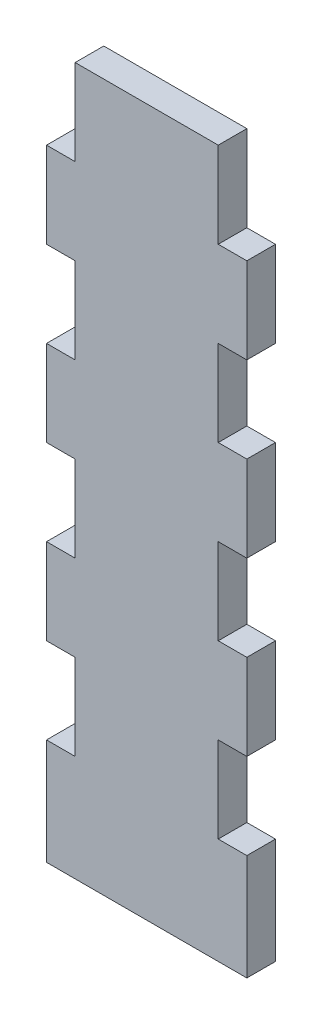
ISO-10303-21;
HEADER;
FILE_DESCRIPTION(('STEP AP214'),'2;1');
FILE_NAME('part.step','',(''),(''),'','','');
FILE_SCHEMA(('AUTOMOTIVE_DESIGN { 1 0 10303 214 1 1 1 1 }'));
ENDSEC;
DATA;
#1=APPLICATION_CONTEXT('core data for automotive mechanical design processes');
#2=APPLICATION_PROTOCOL_DEFINITION('international standard','automotive_design',2000,#1);
#3=PRODUCT_CONTEXT('',#1,'mechanical');
#4=PRODUCT('Part','Part','',(#3));
#5=PRODUCT_RELATED_PRODUCT_CATEGORY('part','',(#4));
#6=PRODUCT_DEFINITION_FORMATION('','',#4);
#7=PRODUCT_DEFINITION_CONTEXT('part definition',#1,'design');
#8=PRODUCT_DEFINITION('design','',#6,#7);
#9=PRODUCT_DEFINITION_SHAPE('','',#8);
#10=(LENGTH_UNIT() NAMED_UNIT(*) SI_UNIT(.MILLI.,.METRE.));
#11=(NAMED_UNIT(*) PLANE_ANGLE_UNIT() SI_UNIT($,.RADIAN.));
#12=(NAMED_UNIT(*) SI_UNIT($,.STERADIAN.) SOLID_ANGLE_UNIT());
#13=UNCERTAINTY_MEASURE_WITH_UNIT(LENGTH_MEASURE(1.E-05),#10,'distance_accuracy_value','');
#14=(GEOMETRIC_REPRESENTATION_CONTEXT(3) GLOBAL_UNCERTAINTY_ASSIGNED_CONTEXT((#13)) GLOBAL_UNIT_ASSIGNED_CONTEXT((#10,
#11,#12)) REPRESENTATION_CONTEXT('',''));
#15=CARTESIAN_POINT('',(0.,0.,0.));
#16=DIRECTION('',(0.,0.,1.));
#17=DIRECTION('',(1.,0.,0.));
#18=AXIS2_PLACEMENT_3D('',#15,#16,#17);
#19=CARTESIAN_POINT('',(24.0093371905544,83.7010211727563,6.));
#20=DIRECTION('',(0.,-1.,0.));
#21=DIRECTION('',(0.,0.,-1.));
#22=AXIS2_PLACEMENT_3D('',#19,#20,#21);
#23=PLANE('',#22);
#24=DIRECTION('',(-1.,0.,0.));
#25=VECTOR('',#24,1.);
#26=CARTESIAN_POINT('',(24.0093371905544,83.7010211727563,0.));
#27=LINE('',#26,#25);
#28=CARTESIAN_POINT('',(24.0093371905544,83.7010211727563,0.));
#29=VERTEX_POINT('',#28);
#30=CARTESIAN_POINT('',(18.0093371905544,83.7010211727563,0.));
#31=VERTEX_POINT('',#30);
#32=EDGE_CURVE('E284',#29,#31,#27,.T.);
#33=ORIENTED_EDGE('',*,*,#32,.F.);
#34=DIRECTION('',(0.,0.,-1.));
#35=VECTOR('',#34,1.);
#36=CARTESIAN_POINT('',(24.0093371905544,83.7010211727563,6.));
#37=LINE('',#36,#35);
#38=CARTESIAN_POINT('',(24.0093371905544,83.7010211727563,6.));
#39=VERTEX_POINT('',#38);
#40=EDGE_CURVE('E11',#39,#29,#37,.T.);
#41=ORIENTED_EDGE('',*,*,#40,.F.);
#42=DIRECTION('',(-1.,0.,0.));
#43=VECTOR('',#42,1.);
#44=CARTESIAN_POINT('',(24.0093371905544,83.7010211727563,6.));
#45=LINE('',#44,#43);
#46=CARTESIAN_POINT('',(18.0093371905544,83.7010211727563,6.));
#47=VERTEX_POINT('',#46);
#48=EDGE_CURVE('E404',#39,#47,#45,.T.);
#49=ORIENTED_EDGE('',*,*,#48,.T.);
#50=DIRECTION('',(0.,0.,-1.));
#51=VECTOR('',#50,1.);
#52=CARTESIAN_POINT('',(18.0093371905544,83.7010211727563,6.));
#53=LINE('',#52,#51);
#54=EDGE_CURVE('E42',#47,#31,#53,.T.);
#55=ORIENTED_EDGE('',*,*,#54,.T.);
#56=EDGE_LOOP('',(#33,#41,#49,#55));
#57=FACE_BOUND('',#56,.T.);
#58=ADVANCED_FACE('F39',(#57),#23,.T.);
#59=CARTESIAN_POINT('',(24.0093371905544,83.7010211727563,6.));
#60=DIRECTION('',(1.,0.,0.));
#61=DIRECTION('',(0.,0.,-1.));
#62=AXIS2_PLACEMENT_3D('',#59,#60,#61);
#63=PLANE('',#62);
#64=DIRECTION('',(0.,-1.,0.));
#65=VECTOR('',#64,1.);
#66=CARTESIAN_POINT('',(24.0093371905544,83.7010211727563,0.));
#67=LINE('',#66,#65);
#68=CARTESIAN_POINT('',(24.0093371905544,65.7010211727563,0.));
#69=VERTEX_POINT('',#68);
#70=EDGE_CURVE('E402',#29,#69,#67,.T.);
#71=ORIENTED_EDGE('',*,*,#70,.T.);
#72=DIRECTION('',(0.,0.,-1.));
#73=VECTOR('',#72,1.);
#74=CARTESIAN_POINT('',(24.0093371905544,65.7010211727563,6.));
#75=LINE('',#74,#73);
#76=CARTESIAN_POINT('',(24.0093371905544,65.7010211727563,6.));
#77=VERTEX_POINT('',#76);
#78=EDGE_CURVE('E49',#77,#69,#75,.T.);
#79=ORIENTED_EDGE('',*,*,#78,.F.);
#80=DIRECTION('',(0.,-1.,0.));
#81=VECTOR('',#80,1.);
#82=CARTESIAN_POINT('',(24.0093371905544,83.7010211727563,6.));
#83=LINE('',#82,#81);
#84=EDGE_CURVE('E277',#39,#77,#83,.T.);
#85=ORIENTED_EDGE('',*,*,#84,.F.);
#86=ORIENTED_EDGE('',*,*,#40,.T.);
#87=EDGE_LOOP('',(#71,#79,#85,#86));
#88=FACE_BOUND('',#87,.T.);
#89=ADVANCED_FACE('F499',(#88),#63,.F.);
#90=CARTESIAN_POINT('',(18.0093371905544,65.7010211727563,6.));
#91=DIRECTION('',(0.,1.,0.));
#92=DIRECTION('',(0.,0.,1.));
#93=AXIS2_PLACEMENT_3D('',#90,#91,#92);
#94=PLANE('',#93);
#95=DIRECTION('',(1.,0.,0.));
#96=VECTOR('',#95,1.);
#97=CARTESIAN_POINT('',(18.0093371905544,65.7010211727563,0.));
#98=LINE('',#97,#96);
#99=CARTESIAN_POINT('',(18.0093371905544,65.7010211727563,0.));
#100=VERTEX_POINT('',#99);
#101=EDGE_CURVE('E261',#100,#69,#98,.T.);
#102=ORIENTED_EDGE('',*,*,#101,.F.);
#103=DIRECTION('',(0.,0.,-1.));
#104=VECTOR('',#103,1.);
#105=CARTESIAN_POINT('',(18.0093371905544,65.7010211727563,6.));
#106=LINE('',#105,#104);
#107=CARTESIAN_POINT('',(18.0093371905544,65.7010211727563,6.));
#108=VERTEX_POINT('',#107);
#109=EDGE_CURVE('E255',#108,#100,#106,.T.);
#110=ORIENTED_EDGE('',*,*,#109,.F.);
#111=DIRECTION('',(1.,0.,0.));
#112=VECTOR('',#111,1.);
#113=CARTESIAN_POINT('',(18.0093371905544,65.7010211727563,6.));
#114=LINE('',#113,#112);
#115=EDGE_CURVE('E259',#108,#77,#114,.T.);
#116=ORIENTED_EDGE('',*,*,#115,.T.);
#117=ORIENTED_EDGE('',*,*,#78,.T.);
#118=EDGE_LOOP('',(#102,#110,#116,#117));
#119=FACE_BOUND('',#118,.T.);
#120=ADVANCED_FACE('F257',(#119),#94,.T.);
#121=CARTESIAN_POINT('',(18.0093371905544,65.7010211727563,6.));
#122=DIRECTION('',(1.,0.,0.));
#123=DIRECTION('',(0.,0.,-1.));
#124=AXIS2_PLACEMENT_3D('',#121,#122,#123);
#125=PLANE('',#124);
#126=DIRECTION('',(0.,-1.,0.));
#127=VECTOR('',#126,1.);
#128=CARTESIAN_POINT('',(18.0093371905544,65.7010211727563,0.));
#129=LINE('',#128,#127);
#130=CARTESIAN_POINT('',(18.0093371905544,47.7010211727563,0.));
#131=VERTEX_POINT('',#130);
#132=EDGE_CURVE('E397',#100,#131,#129,.T.);
#133=ORIENTED_EDGE('',*,*,#132,.T.);
#134=DIRECTION('',(0.,0.,-1.));
#135=VECTOR('',#134,1.);
#136=CARTESIAN_POINT('',(18.0093371905544,47.7010211727563,6.));
#137=LINE('',#136,#135);
#138=CARTESIAN_POINT('',(18.0093371905544,47.7010211727563,6.));
#139=VERTEX_POINT('',#138);
#140=EDGE_CURVE('E266',#139,#131,#137,.T.);
#141=ORIENTED_EDGE('',*,*,#140,.F.);
#142=DIRECTION('',(0.,-1.,0.));
#143=VECTOR('',#142,1.);
#144=CARTESIAN_POINT('',(18.0093371905544,65.7010211727563,6.));
#145=LINE('',#144,#143);
#146=EDGE_CURVE('E269',#108,#139,#145,.T.);
#147=ORIENTED_EDGE('',*,*,#146,.F.);
#148=ORIENTED_EDGE('',*,*,#109,.T.);
#149=EDGE_LOOP('',(#133,#141,#147,#148));
#150=FACE_BOUND('',#149,.T.);
#151=ADVANCED_FACE('F270',(#150),#125,.F.);
#152=CARTESIAN_POINT('',(24.0093371905544,47.7010211727563,6.));
#153=DIRECTION('',(0.,-1.,0.));
#154=DIRECTION('',(0.,0.,-1.));
#155=AXIS2_PLACEMENT_3D('',#152,#153,#154);
#156=PLANE('',#155);
#157=DIRECTION('',(-1.,0.,0.));
#158=VECTOR('',#157,1.);
#159=CARTESIAN_POINT('',(24.0093371905544,47.7010211727563,0.));
#160=LINE('',#159,#158);
#161=CARTESIAN_POINT('',(24.0093371905544,47.7010211727563,0.));
#162=VERTEX_POINT('',#161);
#163=EDGE_CURVE('E393',#162,#131,#160,.T.);
#164=ORIENTED_EDGE('',*,*,#163,.F.);
#165=DIRECTION('',(0.,0.,-1.));
#166=VECTOR('',#165,1.);
#167=CARTESIAN_POINT('',(24.0093371905544,47.7010211727563,6.));
#168=LINE('',#167,#166);
#169=CARTESIAN_POINT('',(24.0093371905544,47.7010211727563,6.));
#170=VERTEX_POINT('',#169);
#171=EDGE_CURVE('E410',#170,#162,#168,.T.);
#172=ORIENTED_EDGE('',*,*,#171,.F.);
#173=DIRECTION('',(-1.,0.,0.));
#174=VECTOR('',#173,1.);
#175=CARTESIAN_POINT('',(24.0093371905544,47.7010211727563,6.));
#176=LINE('',#175,#174);
#177=EDGE_CURVE('E274',#170,#139,#176,.T.);
#178=ORIENTED_EDGE('',*,*,#177,.T.);
#179=ORIENTED_EDGE('',*,*,#140,.T.);
#180=EDGE_LOOP('',(#164,#172,#178,#179));
#181=FACE_BOUND('',#180,.T.);
#182=ADVANCED_FACE('F598',(#181),#156,.T.);
#183=CARTESIAN_POINT('',(24.0093371905544,47.7010211727563,6.));
#184=DIRECTION('',(1.,0.,0.));
#185=DIRECTION('',(0.,0.,-1.));
#186=AXIS2_PLACEMENT_3D('',#183,#184,#185);
#187=PLANE('',#186);
#188=DIRECTION('',(0.,-1.,0.));
#189=VECTOR('',#188,1.);
#190=CARTESIAN_POINT('',(24.0093371905544,47.7010211727563,0.));
#191=LINE('',#190,#189);
#192=CARTESIAN_POINT('',(24.0093371905544,29.7010211727563,0.));
#193=VERTEX_POINT('',#192);
#194=EDGE_CURVE('E389',#162,#193,#191,.T.);
#195=ORIENTED_EDGE('',*,*,#194,.T.);
#196=DIRECTION('',(0.,0.,-1.));
#197=VECTOR('',#196,1.);
#198=CARTESIAN_POINT('',(24.0093371905544,29.7010211727563,6.));
#199=LINE('',#198,#197);
#200=CARTESIAN_POINT('',(24.0093371905544,29.7010211727563,6.));
#201=VERTEX_POINT('',#200);
#202=EDGE_CURVE('E413',#201,#193,#199,.T.);
#203=ORIENTED_EDGE('',*,*,#202,.F.);
#204=DIRECTION('',(0.,-1.,0.));
#205=VECTOR('',#204,1.);
#206=CARTESIAN_POINT('',(24.0093371905544,47.7010211727563,6.));
#207=LINE('',#206,#205);
#208=EDGE_CURVE('E593',#170,#201,#207,.T.);
#209=ORIENTED_EDGE('',*,*,#208,.F.);
#210=ORIENTED_EDGE('',*,*,#171,.T.);
#211=EDGE_LOOP('',(#195,#203,#209,#210));
#212=FACE_BOUND('',#211,.T.);
#213=ADVANCED_FACE('F604',(#212),#187,.F.);
#214=CARTESIAN_POINT('',(18.0093371905544,29.7010211727563,6.));
#215=DIRECTION('',(0.,1.,0.));
#216=DIRECTION('',(0.,0.,1.));
#217=AXIS2_PLACEMENT_3D('',#214,#215,#216);
#218=PLANE('',#217);
#219=DIRECTION('',(1.,0.,0.));
#220=VECTOR('',#219,1.);
#221=CARTESIAN_POINT('',(18.0093371905544,29.7010211727563,0.));
#222=LINE('',#221,#220);
#223=CARTESIAN_POINT('',(18.0093371905544,29.7010211727563,0.));
#224=VERTEX_POINT('',#223);
#225=EDGE_CURVE('E385',#224,#193,#222,.T.);
#226=ORIENTED_EDGE('',*,*,#225,.F.);
#227=DIRECTION('',(0.,0.,-1.));
#228=VECTOR('',#227,1.);
#229=CARTESIAN_POINT('',(18.0093371905544,29.7010211727563,6.));
#230=LINE('',#229,#228);
#231=CARTESIAN_POINT('',(18.0093371905544,29.7010211727563,6.));
#232=VERTEX_POINT('',#231);
#233=EDGE_CURVE('E416',#232,#224,#230,.T.);
#234=ORIENTED_EDGE('',*,*,#233,.F.);
#235=DIRECTION('',(1.,0.,0.));
#236=VECTOR('',#235,1.);
#237=CARTESIAN_POINT('',(18.0093371905544,29.7010211727563,6.));
#238=LINE('',#237,#236);
#239=EDGE_CURVE('E589',#232,#201,#238,.T.);
#240=ORIENTED_EDGE('',*,*,#239,.T.);
#241=ORIENTED_EDGE('',*,*,#202,.T.);
#242=EDGE_LOOP('',(#226,#234,#240,#241));
#243=FACE_BOUND('',#242,.T.);
#244=ADVANCED_FACE('F609',(#243),#218,.T.);
#245=CARTESIAN_POINT('',(18.0093371905544,29.7010211727563,6.));
#246=DIRECTION('',(1.,0.,0.));
#247=DIRECTION('',(0.,0.,-1.));
#248=AXIS2_PLACEMENT_3D('',#245,#246,#247);
#249=PLANE('',#248);
#250=DIRECTION('',(0.,-1.,0.));
#251=VECTOR('',#250,1.);
#252=CARTESIAN_POINT('',(18.0093371905544,29.7010211727563,0.));
#253=LINE('',#252,#251);
#254=CARTESIAN_POINT('',(18.0093371905544,7.47016653515465,0.));
#255=VERTEX_POINT('',#254);
#256=EDGE_CURVE('E382',#224,#255,#253,.T.);
#257=ORIENTED_EDGE('',*,*,#256,.T.);
#258=DIRECTION('',(0.,0.,-1.));
#259=VECTOR('',#258,1.);
#260=CARTESIAN_POINT('',(18.0093371905544,7.47016653515465,6.));
#261=LINE('',#260,#259);
#262=CARTESIAN_POINT('',(18.0093371905544,7.47016653515465,6.));
#263=VERTEX_POINT('',#262);
#264=EDGE_CURVE('E419',#263,#255,#261,.T.);
#265=ORIENTED_EDGE('',*,*,#264,.F.);
#266=DIRECTION('',(0.,1.,0.));
#267=VECTOR('',#266,1.);
#268=CARTESIAN_POINT('',(18.0093371905544,7.47016653515465,6.));
#269=LINE('',#268,#267);
#270=EDGE_CURVE('E586',#263,#232,#269,.T.);
#271=ORIENTED_EDGE('',*,*,#270,.T.);
#272=ORIENTED_EDGE('',*,*,#233,.T.);
#273=EDGE_LOOP('',(#257,#265,#271,#272));
#274=FACE_BOUND('',#273,.T.);
#275=ADVANCED_FACE('F612',(#274),#249,.F.);
#276=CARTESIAN_POINT('',(18.0093371905544,7.47016653515465,6.));
#277=DIRECTION('',(0.,1.,0.));
#278=DIRECTION('',(0.,0.,1.));
#279=AXIS2_PLACEMENT_3D('',#276,#277,#278);
#280=PLANE('',#279);
#281=DIRECTION('',(1.,0.,0.));
#282=VECTOR('',#281,1.);
#283=CARTESIAN_POINT('',(18.0093371905544,7.47016653515465,0.));
#284=LINE('',#283,#282);
#285=CARTESIAN_POINT('',(60.0093371905544,7.47016653515465,0.));
#286=VERTEX_POINT('',#285);
#287=EDGE_CURVE('E379',#255,#286,#284,.T.);
#288=ORIENTED_EDGE('',*,*,#287,.T.);
#289=DIRECTION('',(0.,0.,-1.));
#290=VECTOR('',#289,1.);
#291=CARTESIAN_POINT('',(60.0093371905544,7.47016653515465,6.));
#292=LINE('',#291,#290);
#293=CARTESIAN_POINT('',(60.0093371905544,7.47016653515465,6.));
#294=VERTEX_POINT('',#293);
#295=EDGE_CURVE('E423',#294,#286,#292,.T.);
#296=ORIENTED_EDGE('',*,*,#295,.F.);
#297=DIRECTION('',(1.,0.,0.));
#298=VECTOR('',#297,1.);
#299=CARTESIAN_POINT('',(18.0093371905544,7.47016653515465,6.));
#300=LINE('',#299,#298);
#301=EDGE_CURVE('E582',#263,#294,#300,.T.);
#302=ORIENTED_EDGE('',*,*,#301,.F.);
#303=ORIENTED_EDGE('',*,*,#264,.T.);
#304=EDGE_LOOP('',(#288,#296,#302,#303));
#305=FACE_BOUND('',#304,.T.);
#306=ADVANCED_FACE('F618',(#305),#280,.F.);
#307=CARTESIAN_POINT('',(60.0093371905544,7.47016653515465,6.));
#308=DIRECTION('',(-1.,0.,0.));
#309=DIRECTION('',(0.,0.,1.));
#310=AXIS2_PLACEMENT_3D('',#307,#308,#309);
#311=PLANE('',#310);
#312=DIRECTION('',(0.,1.,0.));
#313=VECTOR('',#312,1.);
#314=CARTESIAN_POINT('',(60.0093371905544,7.47016653515465,0.));
#315=LINE('',#314,#313);
#316=CARTESIAN_POINT('',(60.0093371905544,29.7010211727563,0.));
#317=VERTEX_POINT('',#316);
#318=EDGE_CURVE('E376',#286,#317,#315,.T.);
#319=ORIENTED_EDGE('',*,*,#318,.T.);
#320=DIRECTION('',(0.,0.,-1.));
#321=VECTOR('',#320,1.);
#322=CARTESIAN_POINT('',(60.0093371905544,29.7010211727563,6.));
#323=LINE('',#322,#321);
#324=CARTESIAN_POINT('',(60.0093371905544,29.7010211727563,6.));
#325=VERTEX_POINT('',#324);
#326=EDGE_CURVE('E427',#325,#317,#323,.T.);
#327=ORIENTED_EDGE('',*,*,#326,.F.);
#328=DIRECTION('',(0.,-1.,0.));
#329=VECTOR('',#328,1.);
#330=CARTESIAN_POINT('',(60.0093371905544,29.7010211727563,6.));
#331=LINE('',#330,#329);
#332=EDGE_CURVE('E579',#325,#294,#331,.T.);
#333=ORIENTED_EDGE('',*,*,#332,.T.);
#334=ORIENTED_EDGE('',*,*,#295,.T.);
#335=EDGE_LOOP('',(#319,#327,#333,#334));
#336=FACE_BOUND('',#335,.T.);
#337=ADVANCED_FACE('F621',(#336),#311,.F.);
#338=CARTESIAN_POINT('',(60.0093371905544,29.7010211727563,6.));
#339=DIRECTION('',(0.,-1.,0.));
#340=DIRECTION('',(0.,0.,-1.));
#341=AXIS2_PLACEMENT_3D('',#338,#339,#340);
#342=PLANE('',#341);
#343=DIRECTION('',(-1.,0.,0.));
#344=VECTOR('',#343,1.);
#345=CARTESIAN_POINT('',(60.0093371905544,29.7010211727563,0.));
#346=LINE('',#345,#344);
#347=CARTESIAN_POINT('',(54.0093371905544,29.7010211727563,0.));
#348=VERTEX_POINT('',#347);
#349=EDGE_CURVE('E372',#317,#348,#346,.T.);
#350=ORIENTED_EDGE('',*,*,#349,.T.);
#351=DIRECTION('',(0.,0.,-1.));
#352=VECTOR('',#351,1.);
#353=CARTESIAN_POINT('',(54.0093371905544,29.7010211727563,6.));
#354=LINE('',#353,#352);
#355=CARTESIAN_POINT('',(54.0093371905544,29.7010211727563,6.));
#356=VERTEX_POINT('',#355);
#357=EDGE_CURVE('E431',#356,#348,#354,.T.);
#358=ORIENTED_EDGE('',*,*,#357,.F.);
#359=DIRECTION('',(-1.,0.,0.));
#360=VECTOR('',#359,1.);
#361=CARTESIAN_POINT('',(60.0093371905544,29.7010211727563,6.));
#362=LINE('',#361,#360);
#363=EDGE_CURVE('E576',#325,#356,#362,.T.);
#364=ORIENTED_EDGE('',*,*,#363,.F.);
#365=ORIENTED_EDGE('',*,*,#326,.T.);
#366=EDGE_LOOP('',(#350,#358,#364,#365));
#367=FACE_BOUND('',#366,.T.);
#368=ADVANCED_FACE('F627',(#367),#342,.F.);
#369=CARTESIAN_POINT('',(54.0093371905544,47.7010211727563,6.));
#370=DIRECTION('',(1.,0.,0.));
#371=DIRECTION('',(0.,0.,-1.));
#372=AXIS2_PLACEMENT_3D('',#369,#370,#371);
#373=PLANE('',#372);
#374=DIRECTION('',(0.,-1.,0.));
#375=VECTOR('',#374,1.);
#376=CARTESIAN_POINT('',(54.0093371905544,47.7010211727563,0.));
#377=LINE('',#376,#375);
#378=CARTESIAN_POINT('',(54.0093371905544,47.7010211727563,0.));
#379=VERTEX_POINT('',#378);
#380=EDGE_CURVE('E368',#379,#348,#377,.T.);
#381=ORIENTED_EDGE('',*,*,#380,.F.);
#382=DIRECTION('',(0.,0.,-1.));
#383=VECTOR('',#382,1.);
#384=CARTESIAN_POINT('',(54.0093371905544,47.7010211727563,6.));
#385=LINE('',#384,#383);
#386=CARTESIAN_POINT('',(54.0093371905544,47.7010211727563,6.));
#387=VERTEX_POINT('',#386);
#388=EDGE_CURVE('E434',#387,#379,#385,.T.);
#389=ORIENTED_EDGE('',*,*,#388,.F.);
#390=DIRECTION('',(0.,-1.,0.));
#391=VECTOR('',#390,1.);
#392=CARTESIAN_POINT('',(54.0093371905544,47.7010211727563,6.));
#393=LINE('',#392,#391);
#394=EDGE_CURVE('E572',#387,#356,#393,.T.);
#395=ORIENTED_EDGE('',*,*,#394,.T.);
#396=ORIENTED_EDGE('',*,*,#357,.T.);
#397=EDGE_LOOP('',(#381,#389,#395,#396));
#398=FACE_BOUND('',#397,.T.);
#399=ADVANCED_FACE('F630',(#398),#373,.T.);
#400=CARTESIAN_POINT('',(54.0093371905544,47.7010211727563,6.));
#401=DIRECTION('',(0.,1.,0.));
#402=DIRECTION('',(0.,0.,1.));
#403=AXIS2_PLACEMENT_3D('',#400,#401,#402);
#404=PLANE('',#403);
#405=DIRECTION('',(1.,0.,0.));
#406=VECTOR('',#405,1.);
#407=CARTESIAN_POINT('',(54.0093371905544,47.7010211727563,0.));
#408=LINE('',#407,#406);
#409=CARTESIAN_POINT('',(60.0093371905544,47.7010211727563,0.));
#410=VERTEX_POINT('',#409);
#411=EDGE_CURVE('E364',#379,#410,#408,.T.);
#412=ORIENTED_EDGE('',*,*,#411,.T.);
#413=DIRECTION('',(0.,0.,-1.));
#414=VECTOR('',#413,1.);
#415=CARTESIAN_POINT('',(60.0093371905544,47.7010211727563,6.));
#416=LINE('',#415,#414);
#417=CARTESIAN_POINT('',(60.0093371905544,47.7010211727563,6.));
#418=VERTEX_POINT('',#417);
#419=EDGE_CURVE('E437',#418,#410,#416,.T.);
#420=ORIENTED_EDGE('',*,*,#419,.F.);
#421=DIRECTION('',(1.,0.,0.));
#422=VECTOR('',#421,1.);
#423=CARTESIAN_POINT('',(54.0093371905544,47.7010211727563,6.));
#424=LINE('',#423,#422);
#425=EDGE_CURVE('E569',#387,#418,#424,.T.);
#426=ORIENTED_EDGE('',*,*,#425,.F.);
#427=ORIENTED_EDGE('',*,*,#388,.T.);
#428=EDGE_LOOP('',(#412,#420,#426,#427));
#429=FACE_BOUND('',#428,.T.);
#430=ADVANCED_FACE('F635',(#429),#404,.F.);
#431=CARTESIAN_POINT('',(60.0093371905544,65.7010211727563,6.));
#432=DIRECTION('',(1.,0.,0.));
#433=DIRECTION('',(0.,0.,-1.));
#434=AXIS2_PLACEMENT_3D('',#431,#432,#433);
#435=PLANE('',#434);
#436=DIRECTION('',(0.,-1.,0.));
#437=VECTOR('',#436,1.);
#438=CARTESIAN_POINT('',(60.0093371905544,65.7010211727563,0.));
#439=LINE('',#438,#437);
#440=CARTESIAN_POINT('',(60.0093371905544,65.7010211727563,0.));
#441=VERTEX_POINT('',#440);
#442=EDGE_CURVE('E360',#441,#410,#439,.T.);
#443=ORIENTED_EDGE('',*,*,#442,.F.);
#444=DIRECTION('',(0.,0.,-1.));
#445=VECTOR('',#444,1.);
#446=CARTESIAN_POINT('',(60.0093371905544,65.7010211727563,6.));
#447=LINE('',#446,#445);
#448=CARTESIAN_POINT('',(60.0093371905544,65.7010211727563,6.));
#449=VERTEX_POINT('',#448);
#450=EDGE_CURVE('E440',#449,#441,#447,.T.);
#451=ORIENTED_EDGE('',*,*,#450,.F.);
#452=DIRECTION('',(0.,-1.,0.));
#453=VECTOR('',#452,1.);
#454=CARTESIAN_POINT('',(60.0093371905544,65.7010211727563,6.));
#455=LINE('',#454,#453);
#456=EDGE_CURVE('E565',#449,#418,#455,.T.);
#457=ORIENTED_EDGE('',*,*,#456,.T.);
#458=ORIENTED_EDGE('',*,*,#419,.T.);
#459=EDGE_LOOP('',(#443,#451,#457,#458));
#460=FACE_BOUND('',#459,.T.);
#461=ADVANCED_FACE('F642',(#460),#435,.T.);
#462=CARTESIAN_POINT('',(60.0093371905544,65.7010211727563,6.));
#463=DIRECTION('',(0.,-1.,0.));
#464=DIRECTION('',(0.,0.,-1.));
#465=AXIS2_PLACEMENT_3D('',#462,#463,#464);
#466=PLANE('',#465);
#467=DIRECTION('',(-1.,0.,0.));
#468=VECTOR('',#467,1.);
#469=CARTESIAN_POINT('',(60.0093371905544,65.7010211727563,0.));
#470=LINE('',#469,#468);
#471=CARTESIAN_POINT('',(54.0093371905544,65.7010211727563,0.));
#472=VERTEX_POINT('',#471);
#473=EDGE_CURVE('E356',#441,#472,#470,.T.);
#474=ORIENTED_EDGE('',*,*,#473,.T.);
#475=DIRECTION('',(0.,0.,-1.));
#476=VECTOR('',#475,1.);
#477=CARTESIAN_POINT('',(54.0093371905544,65.7010211727563,6.));
#478=LINE('',#477,#476);
#479=CARTESIAN_POINT('',(54.0093371905544,65.7010211727563,6.));
#480=VERTEX_POINT('',#479);
#481=EDGE_CURVE('E443',#480,#472,#478,.T.);
#482=ORIENTED_EDGE('',*,*,#481,.F.);
#483=DIRECTION('',(-1.,0.,0.));
#484=VECTOR('',#483,1.);
#485=CARTESIAN_POINT('',(60.0093371905544,65.7010211727563,6.));
#486=LINE('',#485,#484);
#487=EDGE_CURVE('E562',#449,#480,#486,.T.);
#488=ORIENTED_EDGE('',*,*,#487,.F.);
#489=ORIENTED_EDGE('',*,*,#450,.T.);
#490=EDGE_LOOP('',(#474,#482,#488,#489));
#491=FACE_BOUND('',#490,.T.);
#492=ADVANCED_FACE('F645',(#491),#466,.F.);
#493=CARTESIAN_POINT('',(54.0093371905544,83.7010211727563,6.));
#494=DIRECTION('',(1.,0.,0.));
#495=DIRECTION('',(0.,0.,-1.));
#496=AXIS2_PLACEMENT_3D('',#493,#494,#495);
#497=PLANE('',#496);
#498=DIRECTION('',(0.,-1.,0.));
#499=VECTOR('',#498,1.);
#500=CARTESIAN_POINT('',(54.0093371905544,83.7010211727563,0.));
#501=LINE('',#500,#499);
#502=CARTESIAN_POINT('',(54.0093371905544,83.7010211727563,0.));
#503=VERTEX_POINT('',#502);
#504=EDGE_CURVE('E352',#503,#472,#501,.T.);
#505=ORIENTED_EDGE('',*,*,#504,.F.);
#506=DIRECTION('',(0.,0.,-1.));
#507=VECTOR('',#506,1.);
#508=CARTESIAN_POINT('',(54.0093371905544,83.7010211727563,6.));
#509=LINE('',#508,#507);
#510=CARTESIAN_POINT('',(54.0093371905544,83.7010211727563,6.));
#511=VERTEX_POINT('',#510);
#512=EDGE_CURVE('E446',#511,#503,#509,.T.);
#513=ORIENTED_EDGE('',*,*,#512,.F.);
#514=DIRECTION('',(0.,-1.,0.));
#515=VECTOR('',#514,1.);
#516=CARTESIAN_POINT('',(54.0093371905544,83.7010211727563,6.));
#517=LINE('',#516,#515);
#518=EDGE_CURVE('E558',#511,#480,#517,.T.);
#519=ORIENTED_EDGE('',*,*,#518,.T.);
#520=ORIENTED_EDGE('',*,*,#481,.T.);
#521=EDGE_LOOP('',(#505,#513,#519,#520));
#522=FACE_BOUND('',#521,.T.);
#523=ADVANCED_FACE('F648',(#522),#497,.T.);
#524=CARTESIAN_POINT('',(54.0093371905544,83.7010211727563,6.));
#525=DIRECTION('',(0.,1.,0.));
#526=DIRECTION('',(0.,0.,1.));
#527=AXIS2_PLACEMENT_3D('',#524,#525,#526);
#528=PLANE('',#527);
#529=DIRECTION('',(1.,0.,0.));
#530=VECTOR('',#529,1.);
#531=CARTESIAN_POINT('',(54.0093371905544,83.7010211727563,0.));
#532=LINE('',#531,#530);
#533=CARTESIAN_POINT('',(60.0093371905544,83.7010211727563,0.));
#534=VERTEX_POINT('',#533);
#535=EDGE_CURVE('E348',#503,#534,#532,.T.);
#536=ORIENTED_EDGE('',*,*,#535,.T.);
#537=DIRECTION('',(0.,0.,-1.));
#538=VECTOR('',#537,1.);
#539=CARTESIAN_POINT('',(60.0093371905544,83.7010211727563,6.));
#540=LINE('',#539,#538);
#541=CARTESIAN_POINT('',(60.0093371905544,83.7010211727563,6.));
#542=VERTEX_POINT('',#541);
#543=EDGE_CURVE('E449',#542,#534,#540,.T.);
#544=ORIENTED_EDGE('',*,*,#543,.F.);
#545=DIRECTION('',(1.,0.,0.));
#546=VECTOR('',#545,1.);
#547=CARTESIAN_POINT('',(54.0093371905544,83.7010211727563,6.));
#548=LINE('',#547,#546);
#549=EDGE_CURVE('E555',#511,#542,#548,.T.);
#550=ORIENTED_EDGE('',*,*,#549,.F.);
#551=ORIENTED_EDGE('',*,*,#512,.T.);
#552=EDGE_LOOP('',(#536,#544,#550,#551));
#553=FACE_BOUND('',#552,.T.);
#554=ADVANCED_FACE('F653',(#553),#528,.F.);
#555=CARTESIAN_POINT('',(60.0093371905544,101.701021172756,6.));
#556=DIRECTION('',(1.,0.,0.));
#557=DIRECTION('',(0.,0.,-1.));
#558=AXIS2_PLACEMENT_3D('',#555,#556,#557);
#559=PLANE('',#558);
#560=DIRECTION('',(0.,-1.,0.));
#561=VECTOR('',#560,1.);
#562=CARTESIAN_POINT('',(60.0093371905544,101.701021172756,0.));
#563=LINE('',#562,#561);
#564=CARTESIAN_POINT('',(60.0093371905544,101.701021172756,0.));
#565=VERTEX_POINT('',#564);
#566=EDGE_CURVE('E344',#565,#534,#563,.T.);
#567=ORIENTED_EDGE('',*,*,#566,.F.);
#568=DIRECTION('',(0.,0.,-1.));
#569=VECTOR('',#568,1.);
#570=CARTESIAN_POINT('',(60.0093371905544,101.701021172756,6.));
#571=LINE('',#570,#569);
#572=CARTESIAN_POINT('',(60.0093371905544,101.701021172756,6.));
#573=VERTEX_POINT('',#572);
#574=EDGE_CURVE('E452',#573,#565,#571,.T.);
#575=ORIENTED_EDGE('',*,*,#574,.F.);
#576=DIRECTION('',(0.,-1.,0.));
#577=VECTOR('',#576,1.);
#578=CARTESIAN_POINT('',(60.0093371905544,101.701021172756,6.));
#579=LINE('',#578,#577);
#580=EDGE_CURVE('E551',#573,#542,#579,.T.);
#581=ORIENTED_EDGE('',*,*,#580,.T.);
#582=ORIENTED_EDGE('',*,*,#543,.T.);
#583=EDGE_LOOP('',(#567,#575,#581,#582));
#584=FACE_BOUND('',#583,.T.);
#585=ADVANCED_FACE('F657',(#584),#559,.T.);
#586=CARTESIAN_POINT('',(60.0093371905544,101.701021172756,6.));
#587=DIRECTION('',(0.,-1.,0.));
#588=DIRECTION('',(0.,0.,-1.));
#589=AXIS2_PLACEMENT_3D('',#586,#587,#588);
#590=PLANE('',#589);
#591=DIRECTION('',(-1.,0.,0.));
#592=VECTOR('',#591,1.);
#593=CARTESIAN_POINT('',(60.0093371905544,101.701021172756,0.));
#594=LINE('',#593,#592);
#595=CARTESIAN_POINT('',(54.0093371905544,101.701021172756,0.));
#596=VERTEX_POINT('',#595);
#597=EDGE_CURVE('E340',#565,#596,#594,.T.);
#598=ORIENTED_EDGE('',*,*,#597,.T.);
#599=DIRECTION('',(0.,0.,-1.));
#600=VECTOR('',#599,1.);
#601=CARTESIAN_POINT('',(54.0093371905544,101.701021172756,6.));
#602=LINE('',#601,#600);
#603=CARTESIAN_POINT('',(54.0093371905544,101.701021172756,6.));
#604=VERTEX_POINT('',#603);
#605=EDGE_CURVE('E455',#604,#596,#602,.T.);
#606=ORIENTED_EDGE('',*,*,#605,.F.);
#607=DIRECTION('',(-1.,0.,0.));
#608=VECTOR('',#607,1.);
#609=CARTESIAN_POINT('',(60.0093371905544,101.701021172756,6.));
#610=LINE('',#609,#608);
#611=EDGE_CURVE('E548',#573,#604,#610,.T.);
#612=ORIENTED_EDGE('',*,*,#611,.F.);
#613=ORIENTED_EDGE('',*,*,#574,.T.);
#614=EDGE_LOOP('',(#598,#606,#612,#613));
#615=FACE_BOUND('',#614,.T.);
#616=ADVANCED_FACE('F662',(#615),#590,.F.);
#617=CARTESIAN_POINT('',(54.0093371905544,119.701021172756,6.));
#618=DIRECTION('',(1.,0.,0.));
#619=DIRECTION('',(0.,0.,-1.));
#620=AXIS2_PLACEMENT_3D('',#617,#618,#619);
#621=PLANE('',#620);
#622=DIRECTION('',(0.,-1.,0.));
#623=VECTOR('',#622,1.);
#624=CARTESIAN_POINT('',(54.0093371905544,119.701021172756,0.));
#625=LINE('',#624,#623);
#626=CARTESIAN_POINT('',(54.0093371905544,119.701021172756,0.));
#627=VERTEX_POINT('',#626);
#628=EDGE_CURVE('E336',#627,#596,#625,.T.);
#629=ORIENTED_EDGE('',*,*,#628,.F.);
#630=DIRECTION('',(0.,0.,-1.));
#631=VECTOR('',#630,1.);
#632=CARTESIAN_POINT('',(54.0093371905544,119.701021172756,6.));
#633=LINE('',#632,#631);
#634=CARTESIAN_POINT('',(54.0093371905544,119.701021172756,6.));
#635=VERTEX_POINT('',#634);
#636=EDGE_CURVE('E458',#635,#627,#633,.T.);
#637=ORIENTED_EDGE('',*,*,#636,.F.);
#638=DIRECTION('',(0.,-1.,0.));
#639=VECTOR('',#638,1.);
#640=CARTESIAN_POINT('',(54.0093371905544,119.701021172756,6.));
#641=LINE('',#640,#639);
#642=EDGE_CURVE('E544',#635,#604,#641,.T.);
#643=ORIENTED_EDGE('',*,*,#642,.T.);
#644=ORIENTED_EDGE('',*,*,#605,.T.);
#645=EDGE_LOOP('',(#629,#637,#643,#644));
#646=FACE_BOUND('',#645,.T.);
#647=ADVANCED_FACE('F669',(#646),#621,.T.);
#648=CARTESIAN_POINT('',(54.0093371905544,119.701021172756,6.));
#649=DIRECTION('',(0.,1.,0.));
#650=DIRECTION('',(0.,0.,1.));
#651=AXIS2_PLACEMENT_3D('',#648,#649,#650);
#652=PLANE('',#651);
#653=DIRECTION('',(1.,0.,0.));
#654=VECTOR('',#653,1.);
#655=CARTESIAN_POINT('',(54.0093371905544,119.701021172756,0.));
#656=LINE('',#655,#654);
#657=CARTESIAN_POINT('',(60.0093371905544,119.701021172756,0.));
#658=VERTEX_POINT('',#657);
#659=EDGE_CURVE('E332',#627,#658,#656,.T.);
#660=ORIENTED_EDGE('',*,*,#659,.T.);
#661=DIRECTION('',(0.,0.,-1.));
#662=VECTOR('',#661,1.);
#663=CARTESIAN_POINT('',(60.0093371905544,119.701021172756,6.));
#664=LINE('',#663,#662);
#665=CARTESIAN_POINT('',(60.0093371905544,119.701021172756,6.));
#666=VERTEX_POINT('',#665);
#667=EDGE_CURVE('E461',#666,#658,#664,.T.);
#668=ORIENTED_EDGE('',*,*,#667,.F.);
#669=DIRECTION('',(1.,0.,0.));
#670=VECTOR('',#669,1.);
#671=CARTESIAN_POINT('',(54.0093371905544,119.701021172756,6.));
#672=LINE('',#671,#670);
#673=EDGE_CURVE('E541',#635,#666,#672,.T.);
#674=ORIENTED_EDGE('',*,*,#673,.F.);
#675=ORIENTED_EDGE('',*,*,#636,.T.);
#676=EDGE_LOOP('',(#660,#668,#674,#675));
#677=FACE_BOUND('',#676,.T.);
#678=ADVANCED_FACE('F672',(#677),#652,.F.);
#679=CARTESIAN_POINT('',(60.0093371905544,137.701021172756,6.));
#680=DIRECTION('',(1.,0.,0.));
#681=DIRECTION('',(0.,0.,-1.));
#682=AXIS2_PLACEMENT_3D('',#679,#680,#681);
#683=PLANE('',#682);
#684=DIRECTION('',(0.,-1.,0.));
#685=VECTOR('',#684,1.);
#686=CARTESIAN_POINT('',(60.0093371905544,137.701021172756,0.));
#687=LINE('',#686,#685);
#688=CARTESIAN_POINT('',(60.0093371905544,137.701021172756,0.));
#689=VERTEX_POINT('',#688);
#690=EDGE_CURVE('E328',#689,#658,#687,.T.);
#691=ORIENTED_EDGE('',*,*,#690,.F.);
#692=DIRECTION('',(0.,0.,-1.));
#693=VECTOR('',#692,1.);
#694=CARTESIAN_POINT('',(60.0093371905544,137.701021172756,6.));
#695=LINE('',#694,#693);
#696=CARTESIAN_POINT('',(60.0093371905544,137.701021172756,6.));
#697=VERTEX_POINT('',#696);
#698=EDGE_CURVE('E464',#697,#689,#695,.T.);
#699=ORIENTED_EDGE('',*,*,#698,.F.);
#700=DIRECTION('',(0.,-1.,0.));
#701=VECTOR('',#700,1.);
#702=CARTESIAN_POINT('',(60.0093371905544,137.701021172756,6.));
#703=LINE('',#702,#701);
#704=EDGE_CURVE('E537',#697,#666,#703,.T.);
#705=ORIENTED_EDGE('',*,*,#704,.T.);
#706=ORIENTED_EDGE('',*,*,#667,.T.);
#707=EDGE_LOOP('',(#691,#699,#705,#706));
#708=FACE_BOUND('',#707,.T.);
#709=ADVANCED_FACE('F675',(#708),#683,.T.);
#710=CARTESIAN_POINT('',(60.0093371905544,137.701021172756,6.));
#711=DIRECTION('',(0.,-1.,0.));
#712=DIRECTION('',(0.,0.,-1.));
#713=AXIS2_PLACEMENT_3D('',#710,#711,#712);
#714=PLANE('',#713);
#715=DIRECTION('',(-1.,0.,0.));
#716=VECTOR('',#715,1.);
#717=CARTESIAN_POINT('',(60.0093371905544,137.701021172756,0.));
#718=LINE('',#717,#716);
#719=CARTESIAN_POINT('',(54.0093371905544,137.701021172756,0.));
#720=VERTEX_POINT('',#719);
#721=EDGE_CURVE('E324',#689,#720,#718,.T.);
#722=ORIENTED_EDGE('',*,*,#721,.T.);
#723=DIRECTION('',(0.,0.,-1.));
#724=VECTOR('',#723,1.);
#725=CARTESIAN_POINT('',(54.0093371905544,137.701021172756,6.));
#726=LINE('',#725,#724);
#727=CARTESIAN_POINT('',(54.0093371905544,137.701021172756,6.));
#728=VERTEX_POINT('',#727);
#729=EDGE_CURVE('E467',#728,#720,#726,.T.);
#730=ORIENTED_EDGE('',*,*,#729,.F.);
#731=DIRECTION('',(-1.,0.,0.));
#732=VECTOR('',#731,1.);
#733=CARTESIAN_POINT('',(60.0093371905544,137.701021172756,6.));
#734=LINE('',#733,#732);
#735=EDGE_CURVE('E534',#697,#728,#734,.T.);
#736=ORIENTED_EDGE('',*,*,#735,.F.);
#737=ORIENTED_EDGE('',*,*,#698,.T.);
#738=EDGE_LOOP('',(#722,#730,#736,#737));
#739=FACE_BOUND('',#738,.T.);
#740=ADVANCED_FACE('F681',(#739),#714,.F.);
#741=CARTESIAN_POINT('',(54.0093371905544,155.701021172756,6.));
#742=DIRECTION('',(1.,0.,0.));
#743=DIRECTION('',(0.,0.,-1.));
#744=AXIS2_PLACEMENT_3D('',#741,#742,#743);
#745=PLANE('',#744);
#746=DIRECTION('',(0.,-1.,0.));
#747=VECTOR('',#746,1.);
#748=CARTESIAN_POINT('',(54.0093371905544,155.701021172756,0.));
#749=LINE('',#748,#747);
#750=CARTESIAN_POINT('',(54.0093371905544,155.701021172756,0.));
#751=VERTEX_POINT('',#750);
#752=EDGE_CURVE('E320',#751,#720,#749,.T.);
#753=ORIENTED_EDGE('',*,*,#752,.F.);
#754=DIRECTION('',(0.,0.,-1.));
#755=VECTOR('',#754,1.);
#756=CARTESIAN_POINT('',(54.0093371905544,155.701021172756,6.));
#757=LINE('',#756,#755);
#758=CARTESIAN_POINT('',(54.0093371905544,155.701021172756,6.));
#759=VERTEX_POINT('',#758);
#760=EDGE_CURVE('E470',#759,#751,#757,.T.);
#761=ORIENTED_EDGE('',*,*,#760,.F.);
#762=DIRECTION('',(0.,-1.,0.));
#763=VECTOR('',#762,1.);
#764=CARTESIAN_POINT('',(54.0093371905544,155.701021172756,6.));
#765=LINE('',#764,#763);
#766=EDGE_CURVE('E530',#759,#728,#765,.T.);
#767=ORIENTED_EDGE('',*,*,#766,.T.);
#768=ORIENTED_EDGE('',*,*,#729,.T.);
#769=EDGE_LOOP('',(#753,#761,#767,#768));
#770=FACE_BOUND('',#769,.T.);
#771=ADVANCED_FACE('F685',(#770),#745,.T.);
#772=CARTESIAN_POINT('',(24.0093371905544,155.701021172756,6.));
#773=DIRECTION('',(0.,1.,0.));
#774=DIRECTION('',(0.,0.,1.));
#775=AXIS2_PLACEMENT_3D('',#772,#773,#774);
#776=PLANE('',#775);
#777=DIRECTION('',(1.,0.,0.));
#778=VECTOR('',#777,1.);
#779=CARTESIAN_POINT('',(24.0093371905544,155.701021172756,0.));
#780=LINE('',#779,#778);
#781=CARTESIAN_POINT('',(24.0093371905544,155.701021172756,0.));
#782=VERTEX_POINT('',#781);
#783=EDGE_CURVE('E316',#782,#751,#780,.T.);
#784=ORIENTED_EDGE('',*,*,#783,.F.);
#785=DIRECTION('',(0.,0.,-1.));
#786=VECTOR('',#785,1.);
#787=CARTESIAN_POINT('',(24.0093371905544,155.701021172756,6.));
#788=LINE('',#787,#786);
#789=CARTESIAN_POINT('',(24.0093371905544,155.701021172756,6.));
#790=VERTEX_POINT('',#789);
#791=EDGE_CURVE('E473',#790,#782,#788,.T.);
#792=ORIENTED_EDGE('',*,*,#791,.F.);
#793=DIRECTION('',(1.,0.,0.));
#794=VECTOR('',#793,1.);
#795=CARTESIAN_POINT('',(24.0093371905544,155.701021172756,6.));
#796=LINE('',#795,#794);
#797=EDGE_CURVE('E526',#790,#759,#796,.T.);
#798=ORIENTED_EDGE('',*,*,#797,.T.);
#799=ORIENTED_EDGE('',*,*,#760,.T.);
#800=EDGE_LOOP('',(#784,#792,#798,#799));
#801=FACE_BOUND('',#800,.T.);
#802=ADVANCED_FACE('F688',(#801),#776,.T.);
#803=CARTESIAN_POINT('',(24.0093371905544,155.701021172756,6.));
#804=DIRECTION('',(1.,0.,0.));
#805=DIRECTION('',(0.,0.,-1.));
#806=AXIS2_PLACEMENT_3D('',#803,#804,#805);
#807=PLANE('',#806);
#808=DIRECTION('',(0.,-1.,0.));
#809=VECTOR('',#808,1.);
#810=CARTESIAN_POINT('',(24.0093371905544,155.701021172756,0.));
#811=LINE('',#810,#809);
#812=CARTESIAN_POINT('',(24.0093371905544,137.701021172756,0.));
#813=VERTEX_POINT('',#812);
#814=EDGE_CURVE('E312',#782,#813,#811,.T.);
#815=ORIENTED_EDGE('',*,*,#814,.T.);
#816=DIRECTION('',(0.,0.,-1.));
#817=VECTOR('',#816,1.);
#818=CARTESIAN_POINT('',(24.0093371905544,137.701021172756,6.));
#819=LINE('',#818,#817);
#820=CARTESIAN_POINT('',(24.0093371905544,137.701021172756,6.));
#821=VERTEX_POINT('',#820);
#822=EDGE_CURVE('E476',#821,#813,#819,.T.);
#823=ORIENTED_EDGE('',*,*,#822,.F.);
#824=DIRECTION('',(0.,-1.,0.));
#825=VECTOR('',#824,1.);
#826=CARTESIAN_POINT('',(24.0093371905544,155.701021172756,6.));
#827=LINE('',#826,#825);
#828=EDGE_CURVE('E523',#790,#821,#827,.T.);
#829=ORIENTED_EDGE('',*,*,#828,.F.);
#830=ORIENTED_EDGE('',*,*,#791,.T.);
#831=EDGE_LOOP('',(#815,#823,#829,#830));
#832=FACE_BOUND('',#831,.T.);
#833=ADVANCED_FACE('F693',(#832),#807,.F.);
#834=CARTESIAN_POINT('',(18.0093371905544,137.701021172756,6.));
#835=DIRECTION('',(0.,1.,0.));
#836=DIRECTION('',(0.,0.,1.));
#837=AXIS2_PLACEMENT_3D('',#834,#835,#836);
#838=PLANE('',#837);
#839=DIRECTION('',(1.,0.,0.));
#840=VECTOR('',#839,1.);
#841=CARTESIAN_POINT('',(18.0093371905544,137.701021172756,0.));
#842=LINE('',#841,#840);
#843=CARTESIAN_POINT('',(18.0093371905544,137.701021172756,0.));
#844=VERTEX_POINT('',#843);
#845=EDGE_CURVE('E308',#844,#813,#842,.T.);
#846=ORIENTED_EDGE('',*,*,#845,.F.);
#847=DIRECTION('',(0.,0.,-1.));
#848=VECTOR('',#847,1.);
#849=CARTESIAN_POINT('',(18.0093371905544,137.701021172756,6.));
#850=LINE('',#849,#848);
#851=CARTESIAN_POINT('',(18.0093371905544,137.701021172756,6.));
#852=VERTEX_POINT('',#851);
#853=EDGE_CURVE('E479',#852,#844,#850,.T.);
#854=ORIENTED_EDGE('',*,*,#853,.F.);
#855=DIRECTION('',(1.,0.,0.));
#856=VECTOR('',#855,1.);
#857=CARTESIAN_POINT('',(18.0093371905544,137.701021172756,6.));
#858=LINE('',#857,#856);
#859=EDGE_CURVE('E519',#852,#821,#858,.T.);
#860=ORIENTED_EDGE('',*,*,#859,.T.);
#861=ORIENTED_EDGE('',*,*,#822,.T.);
#862=EDGE_LOOP('',(#846,#854,#860,#861));
#863=FACE_BOUND('',#862,.T.);
#864=ADVANCED_FACE('F697',(#863),#838,.T.);
#865=CARTESIAN_POINT('',(18.0093371905544,137.701021172756,6.));
#866=DIRECTION('',(1.,0.,0.));
#867=DIRECTION('',(0.,0.,-1.));
#868=AXIS2_PLACEMENT_3D('',#865,#866,#867);
#869=PLANE('',#868);
#870=DIRECTION('',(0.,-1.,0.));
#871=VECTOR('',#870,1.);
#872=CARTESIAN_POINT('',(18.0093371905544,137.701021172756,0.));
#873=LINE('',#872,#871);
#874=CARTESIAN_POINT('',(18.0093371905544,119.701021172756,0.));
#875=VERTEX_POINT('',#874);
#876=EDGE_CURVE('E304',#844,#875,#873,.T.);
#877=ORIENTED_EDGE('',*,*,#876,.T.);
#878=DIRECTION('',(0.,0.,-1.));
#879=VECTOR('',#878,1.);
#880=CARTESIAN_POINT('',(18.0093371905544,119.701021172756,6.));
#881=LINE('',#880,#879);
#882=CARTESIAN_POINT('',(18.0093371905544,119.701021172756,6.));
#883=VERTEX_POINT('',#882);
#884=EDGE_CURVE('E482',#883,#875,#881,.T.);
#885=ORIENTED_EDGE('',*,*,#884,.F.);
#886=DIRECTION('',(0.,-1.,0.));
#887=VECTOR('',#886,1.);
#888=CARTESIAN_POINT('',(18.0093371905544,137.701021172756,6.));
#889=LINE('',#888,#887);
#890=EDGE_CURVE('E516',#852,#883,#889,.T.);
#891=ORIENTED_EDGE('',*,*,#890,.F.);
#892=ORIENTED_EDGE('',*,*,#853,.T.);
#893=EDGE_LOOP('',(#877,#885,#891,#892));
#894=FACE_BOUND('',#893,.T.);
#895=ADVANCED_FACE('F702',(#894),#869,.F.);
#896=CARTESIAN_POINT('',(24.0093371905544,119.701021172756,6.));
#897=DIRECTION('',(0.,-1.,0.));
#898=DIRECTION('',(0.,0.,-1.));
#899=AXIS2_PLACEMENT_3D('',#896,#897,#898);
#900=PLANE('',#899);
#901=DIRECTION('',(-1.,0.,0.));
#902=VECTOR('',#901,1.);
#903=CARTESIAN_POINT('',(24.0093371905544,119.701021172756,0.));
#904=LINE('',#903,#902);
#905=CARTESIAN_POINT('',(24.0093371905544,119.701021172756,0.));
#906=VERTEX_POINT('',#905);
#907=EDGE_CURVE('E300',#906,#875,#904,.T.);
#908=ORIENTED_EDGE('',*,*,#907,.F.);
#909=DIRECTION('',(0.,0.,-1.));
#910=VECTOR('',#909,1.);
#911=CARTESIAN_POINT('',(24.0093371905544,119.701021172756,6.));
#912=LINE('',#911,#910);
#913=CARTESIAN_POINT('',(24.0093371905544,119.701021172756,6.));
#914=VERTEX_POINT('',#913);
#915=EDGE_CURVE('E485',#914,#906,#912,.T.);
#916=ORIENTED_EDGE('',*,*,#915,.F.);
#917=DIRECTION('',(-1.,0.,0.));
#918=VECTOR('',#917,1.);
#919=CARTESIAN_POINT('',(24.0093371905544,119.701021172756,6.));
#920=LINE('',#919,#918);
#921=EDGE_CURVE('E512',#914,#883,#920,.T.);
#922=ORIENTED_EDGE('',*,*,#921,.T.);
#923=ORIENTED_EDGE('',*,*,#884,.T.);
#924=EDGE_LOOP('',(#908,#916,#922,#923));
#925=FACE_BOUND('',#924,.T.);
#926=ADVANCED_FACE('F708',(#925),#900,.T.);
#927=CARTESIAN_POINT('',(24.0093371905544,119.701021172756,6.));
#928=DIRECTION('',(1.,0.,0.));
#929=DIRECTION('',(0.,0.,-1.));
#930=AXIS2_PLACEMENT_3D('',#927,#928,#929);
#931=PLANE('',#930);
#932=DIRECTION('',(0.,-1.,0.));
#933=VECTOR('',#932,1.);
#934=CARTESIAN_POINT('',(24.0093371905544,119.701021172756,0.));
#935=LINE('',#934,#933);
#936=CARTESIAN_POINT('',(24.0093371905544,101.701021172756,0.));
#937=VERTEX_POINT('',#936);
#938=EDGE_CURVE('E296',#906,#937,#935,.T.);
#939=ORIENTED_EDGE('',*,*,#938,.T.);
#940=DIRECTION('',(0.,0.,-1.));
#941=VECTOR('',#940,1.);
#942=CARTESIAN_POINT('',(24.0093371905544,101.701021172756,6.));
#943=LINE('',#942,#941);
#944=CARTESIAN_POINT('',(24.0093371905544,101.701021172756,6.));
#945=VERTEX_POINT('',#944);
#946=EDGE_CURVE('E488',#945,#937,#943,.T.);
#947=ORIENTED_EDGE('',*,*,#946,.F.);
#948=DIRECTION('',(0.,-1.,0.));
#949=VECTOR('',#948,1.);
#950=CARTESIAN_POINT('',(24.0093371905544,119.701021172756,6.));
#951=LINE('',#950,#949);
#952=EDGE_CURVE('E509',#914,#945,#951,.T.);
#953=ORIENTED_EDGE('',*,*,#952,.F.);
#954=ORIENTED_EDGE('',*,*,#915,.T.);
#955=EDGE_LOOP('',(#939,#947,#953,#954));
#956=FACE_BOUND('',#955,.T.);
#957=ADVANCED_FACE('F711',(#956),#931,.F.);
#958=CARTESIAN_POINT('',(18.0093371905544,101.701021172756,6.));
#959=DIRECTION('',(0.,1.,0.));
#960=DIRECTION('',(0.,0.,1.));
#961=AXIS2_PLACEMENT_3D('',#958,#959,#960);
#962=PLANE('',#961);
#963=DIRECTION('',(1.,0.,0.));
#964=VECTOR('',#963,1.);
#965=CARTESIAN_POINT('',(18.0093371905544,101.701021172756,0.));
#966=LINE('',#965,#964);
#967=CARTESIAN_POINT('',(18.0093371905544,101.701021172756,0.));
#968=VERTEX_POINT('',#967);
#969=EDGE_CURVE('E292',#968,#937,#966,.T.);
#970=ORIENTED_EDGE('',*,*,#969,.F.);
#971=DIRECTION('',(0.,0.,-1.));
#972=VECTOR('',#971,1.);
#973=CARTESIAN_POINT('',(18.0093371905544,101.701021172756,6.));
#974=LINE('',#973,#972);
#975=CARTESIAN_POINT('',(18.0093371905544,101.701021172756,6.));
#976=VERTEX_POINT('',#975);
#977=EDGE_CURVE('E490',#976,#968,#974,.T.);
#978=ORIENTED_EDGE('',*,*,#977,.F.);
#979=DIRECTION('',(1.,0.,0.));
#980=VECTOR('',#979,1.);
#981=CARTESIAN_POINT('',(18.0093371905544,101.701021172756,6.));
#982=LINE('',#981,#980);
#983=EDGE_CURVE('E503',#976,#945,#982,.T.);
#984=ORIENTED_EDGE('',*,*,#983,.T.);
#985=ORIENTED_EDGE('',*,*,#946,.T.);
#986=EDGE_LOOP('',(#970,#978,#984,#985));
#987=FACE_BOUND('',#986,.T.);
#988=ADVANCED_FACE('F713',(#987),#962,.T.);
#989=CARTESIAN_POINT('',(18.0093371905544,101.701021172756,6.));
#990=DIRECTION('',(1.,0.,0.));
#991=DIRECTION('',(0.,0.,-1.));
#992=AXIS2_PLACEMENT_3D('',#989,#990,#991);
#993=PLANE('',#992);
#994=DIRECTION('',(0.,-1.,0.));
#995=VECTOR('',#994,1.);
#996=CARTESIAN_POINT('',(18.0093371905544,101.701021172756,0.));
#997=LINE('',#996,#995);
#998=EDGE_CURVE('E288',#968,#31,#997,.T.);
#999=ORIENTED_EDGE('',*,*,#998,.T.);
#1000=ORIENTED_EDGE('',*,*,#54,.F.);
#1001=DIRECTION('',(0.,-1.,0.));
#1002=VECTOR('',#1001,1.);
#1003=CARTESIAN_POINT('',(18.0093371905544,101.701021172756,6.));
#1004=LINE('',#1003,#1002);
#1005=EDGE_CURVE('E169',#976,#47,#1004,.T.);
#1006=ORIENTED_EDGE('',*,*,#1005,.F.);
#1007=ORIENTED_EDGE('',*,*,#977,.T.);
#1008=EDGE_LOOP('',(#999,#1000,#1006,#1007));
#1009=FACE_BOUND('',#1008,.T.);
#1010=ADVANCED_FACE('F495',(#1009),#993,.F.);
#1011=CARTESIAN_POINT('',(0.,0.,6.));
#1012=DIRECTION('',(0.,0.,1.));
#1013=DIRECTION('',(1.,0.,0.));
#1014=AXIS2_PLACEMENT_3D('',#1011,#1012,#1013);
#1015=PLANE('',#1014);
#1016=ORIENTED_EDGE('',*,*,#48,.F.);
#1017=ORIENTED_EDGE('',*,*,#84,.T.);
#1018=ORIENTED_EDGE('',*,*,#115,.F.);
#1019=ORIENTED_EDGE('',*,*,#146,.T.);
#1020=ORIENTED_EDGE('',*,*,#177,.F.);
#1021=ORIENTED_EDGE('',*,*,#208,.T.);
#1022=ORIENTED_EDGE('',*,*,#239,.F.);
#1023=ORIENTED_EDGE('',*,*,#270,.F.);
#1024=ORIENTED_EDGE('',*,*,#301,.T.);
#1025=ORIENTED_EDGE('',*,*,#332,.F.);
#1026=ORIENTED_EDGE('',*,*,#363,.T.);
#1027=ORIENTED_EDGE('',*,*,#394,.F.);
#1028=ORIENTED_EDGE('',*,*,#425,.T.);
#1029=ORIENTED_EDGE('',*,*,#456,.F.);
#1030=ORIENTED_EDGE('',*,*,#487,.T.);
#1031=ORIENTED_EDGE('',*,*,#518,.F.);
#1032=ORIENTED_EDGE('',*,*,#549,.T.);
#1033=ORIENTED_EDGE('',*,*,#580,.F.);
#1034=ORIENTED_EDGE('',*,*,#611,.T.);
#1035=ORIENTED_EDGE('',*,*,#642,.F.);
#1036=ORIENTED_EDGE('',*,*,#673,.T.);
#1037=ORIENTED_EDGE('',*,*,#704,.F.);
#1038=ORIENTED_EDGE('',*,*,#735,.T.);
#1039=ORIENTED_EDGE('',*,*,#766,.F.);
#1040=ORIENTED_EDGE('',*,*,#797,.F.);
#1041=ORIENTED_EDGE('',*,*,#828,.T.);
#1042=ORIENTED_EDGE('',*,*,#859,.F.);
#1043=ORIENTED_EDGE('',*,*,#890,.T.);
#1044=ORIENTED_EDGE('',*,*,#921,.F.);
#1045=ORIENTED_EDGE('',*,*,#952,.T.);
#1046=ORIENTED_EDGE('',*,*,#983,.F.);
#1047=ORIENTED_EDGE('',*,*,#1005,.T.);
#1048=EDGE_LOOP('',(#1016,#1017,#1018,#1019,#1020,#1021,#1022,#1023,#1024,#1025,#1026,#1027,
#1028,#1029,#1030,#1031,#1032,#1033,#1034,#1035,#1036,#1037,#1038,#1039,#1040,#1041,#1042,#1043,
#1044,#1045,#1046,#1047));
#1049=FACE_BOUND('',#1048,.T.);
#1050=ADVANCED_FACE('F276',(#1049),#1015,.T.);
#1051=CARTESIAN_POINT('',(0.,0.,0.));
#1052=DIRECTION('',(0.,0.,1.));
#1053=DIRECTION('',(1.,0.,0.));
#1054=AXIS2_PLACEMENT_3D('',#1051,#1052,#1053);
#1055=PLANE('',#1054);
#1056=ORIENTED_EDGE('',*,*,#32,.T.);
#1057=ORIENTED_EDGE('',*,*,#998,.F.);
#1058=ORIENTED_EDGE('',*,*,#969,.T.);
#1059=ORIENTED_EDGE('',*,*,#938,.F.);
#1060=ORIENTED_EDGE('',*,*,#907,.T.);
#1061=ORIENTED_EDGE('',*,*,#876,.F.);
#1062=ORIENTED_EDGE('',*,*,#845,.T.);
#1063=ORIENTED_EDGE('',*,*,#814,.F.);
#1064=ORIENTED_EDGE('',*,*,#783,.T.);
#1065=ORIENTED_EDGE('',*,*,#752,.T.);
#1066=ORIENTED_EDGE('',*,*,#721,.F.);
#1067=ORIENTED_EDGE('',*,*,#690,.T.);
#1068=ORIENTED_EDGE('',*,*,#659,.F.);
#1069=ORIENTED_EDGE('',*,*,#628,.T.);
#1070=ORIENTED_EDGE('',*,*,#597,.F.);
#1071=ORIENTED_EDGE('',*,*,#566,.T.);
#1072=ORIENTED_EDGE('',*,*,#535,.F.);
#1073=ORIENTED_EDGE('',*,*,#504,.T.);
#1074=ORIENTED_EDGE('',*,*,#473,.F.);
#1075=ORIENTED_EDGE('',*,*,#442,.T.);
#1076=ORIENTED_EDGE('',*,*,#411,.F.);
#1077=ORIENTED_EDGE('',*,*,#380,.T.);
#1078=ORIENTED_EDGE('',*,*,#349,.F.);
#1079=ORIENTED_EDGE('',*,*,#318,.F.);
#1080=ORIENTED_EDGE('',*,*,#287,.F.);
#1081=ORIENTED_EDGE('',*,*,#256,.F.);
#1082=ORIENTED_EDGE('',*,*,#225,.T.);
#1083=ORIENTED_EDGE('',*,*,#194,.F.);
#1084=ORIENTED_EDGE('',*,*,#163,.T.);
#1085=ORIENTED_EDGE('',*,*,#132,.F.);
#1086=ORIENTED_EDGE('',*,*,#101,.T.);
#1087=ORIENTED_EDGE('',*,*,#70,.F.);
#1088=EDGE_LOOP('',(#1056,#1057,#1058,#1059,#1060,#1061,#1062,#1063,#1064,#1065,#1066,#1067,
#1068,#1069,#1070,#1071,#1072,#1073,#1074,#1075,#1076,#1077,#1078,#1079,#1080,#1081,#1082,#1083,
#1084,#1085,#1086,#1087));
#1089=FACE_BOUND('',#1088,.T.);
#1090=ADVANCED_FACE('F498',(#1089),#1055,.F.);
#1091=CLOSED_SHELL('',(#58,#89,#120,#151,#182,#213,#244,#275,#306,#337,#368,#399,#430,#461,#492,
#523,#554,#585,#616,#647,#678,#709,#740,#771,#802,#833,#864,#895,#926,#957,#988,#1010,#1050,#1090));
#1092=MANIFOLD_SOLID_BREP('B2',#1091);
#1093=ADVANCED_BREP_SHAPE_REPRESENTATION('',(#18,#1092),#14);
#1094=SHAPE_DEFINITION_REPRESENTATION(#9,#1093);
ENDSEC;
END-ISO-10303-21;
